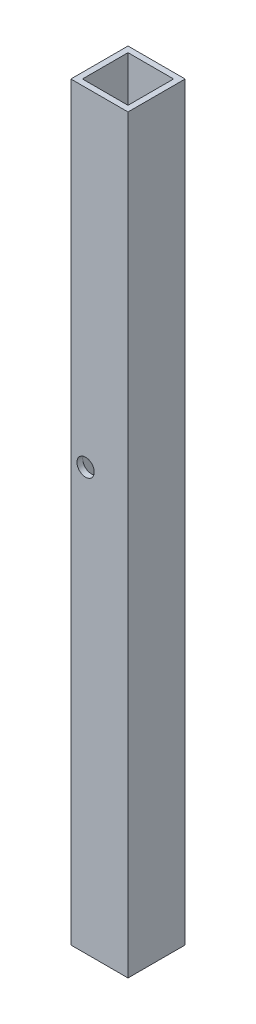
ISO-10303-21;
HEADER;
FILE_DESCRIPTION(('STEP AP214'),'2;1');
FILE_NAME('part.step','',(''),(''),'','','');
FILE_SCHEMA(('AUTOMOTIVE_DESIGN { 1 0 10303 214 1 1 1 1 }'));
ENDSEC;
DATA;
#1=APPLICATION_CONTEXT('core data for automotive mechanical design processes');
#2=APPLICATION_PROTOCOL_DEFINITION('international standard','automotive_design',2000,#1);
#3=PRODUCT_CONTEXT('',#1,'mechanical');
#4=PRODUCT('Part','Part','',(#3));
#5=PRODUCT_RELATED_PRODUCT_CATEGORY('part','',(#4));
#6=PRODUCT_DEFINITION_FORMATION('','',#4);
#7=PRODUCT_DEFINITION_CONTEXT('part definition',#1,'design');
#8=PRODUCT_DEFINITION('design','',#6,#7);
#9=PRODUCT_DEFINITION_SHAPE('','',#8);
#10=(LENGTH_UNIT() NAMED_UNIT(*) SI_UNIT(.MILLI.,.METRE.));
#11=(NAMED_UNIT(*) PLANE_ANGLE_UNIT() SI_UNIT($,.RADIAN.));
#12=(NAMED_UNIT(*) SI_UNIT($,.STERADIAN.) SOLID_ANGLE_UNIT());
#13=UNCERTAINTY_MEASURE_WITH_UNIT(LENGTH_MEASURE(1.E-05),#10,'distance_accuracy_value','');
#14=(GEOMETRIC_REPRESENTATION_CONTEXT(3) GLOBAL_UNCERTAINTY_ASSIGNED_CONTEXT((#13)) GLOBAL_UNIT_ASSIGNED_CONTEXT((#10,
#11,#12)) REPRESENTATION_CONTEXT('',''));
#15=CARTESIAN_POINT('',(0.,0.,0.));
#16=DIRECTION('',(0.,0.,1.));
#17=DIRECTION('',(1.,0.,0.));
#18=AXIS2_PLACEMENT_3D('',#15,#16,#17);
#19=CARTESIAN_POINT('',(0.,130.,0.));
#20=DIRECTION('',(0.,1.,0.));
#21=DIRECTION('',(0.,0.,1.));
#22=AXIS2_PLACEMENT_3D('',#19,#20,#21);
#23=PLANE('',#22);
#24=DIRECTION('',(0.,0.,1.));
#25=VECTOR('',#24,1.);
#26=CARTESIAN_POINT('',(-4.95,130.,4.95));
#27=LINE('',#26,#25);
#28=CARTESIAN_POINT('',(-4.95,130.,-4.95));
#29=VERTEX_POINT('',#28);
#30=CARTESIAN_POINT('',(-4.95,130.,4.95));
#31=VERTEX_POINT('',#30);
#32=EDGE_CURVE('E139',#29,#31,#27,.T.);
#33=ORIENTED_EDGE('',*,*,#32,.T.);
#34=DIRECTION('',(1.,0.,0.));
#35=VECTOR('',#34,1.);
#36=CARTESIAN_POINT('',(4.95,130.,4.95));
#37=LINE('',#36,#35);
#38=CARTESIAN_POINT('',(4.95,130.,4.95));
#39=VERTEX_POINT('',#38);
#40=EDGE_CURVE('E142',#31,#39,#37,.T.);
#41=ORIENTED_EDGE('',*,*,#40,.T.);
#42=DIRECTION('',(0.,0.,-1.));
#43=VECTOR('',#42,1.);
#44=CARTESIAN_POINT('',(4.95,130.,4.95));
#45=LINE('',#44,#43);
#46=CARTESIAN_POINT('',(4.95,130.,-4.95));
#47=VERTEX_POINT('',#46);
#48=EDGE_CURVE('E145',#39,#47,#45,.T.);
#49=ORIENTED_EDGE('',*,*,#48,.T.);
#50=DIRECTION('',(-1.,0.,0.));
#51=VECTOR('',#50,1.);
#52=CARTESIAN_POINT('',(4.95,130.,-4.95));
#53=LINE('',#52,#51);
#54=EDGE_CURVE('E147',#47,#29,#53,.T.);
#55=ORIENTED_EDGE('',*,*,#54,.T.);
#56=EDGE_LOOP('',(#33,#41,#49,#55));
#57=FACE_BOUND('',#56,.T.);
#58=DIRECTION('',(-1.,0.,0.));
#59=VECTOR('',#58,1.);
#60=CARTESIAN_POINT('',(-3.95,130.,-3.95));
#61=LINE('',#60,#59);
#62=CARTESIAN_POINT('',(3.95,130.,-3.95));
#63=VERTEX_POINT('',#62);
#64=CARTESIAN_POINT('',(-3.95,130.,-3.95));
#65=VERTEX_POINT('',#64);
#66=EDGE_CURVE('E109',#63,#65,#61,.T.);
#67=ORIENTED_EDGE('',*,*,#66,.F.);
#68=DIRECTION('',(0.,0.,-1.));
#69=VECTOR('',#68,1.);
#70=CARTESIAN_POINT('',(3.95,130.,3.95));
#71=LINE('',#70,#69);
#72=CARTESIAN_POINT('',(3.95,130.,3.95));
#73=VERTEX_POINT('',#72);
#74=EDGE_CURVE('E101',#73,#63,#71,.T.);
#75=ORIENTED_EDGE('',*,*,#74,.F.);
#76=DIRECTION('',(1.,0.,0.));
#77=VECTOR('',#76,1.);
#78=CARTESIAN_POINT('',(-3.95,130.,3.95));
#79=LINE('',#78,#77);
#80=CARTESIAN_POINT('',(-3.95,130.,3.95));
#81=VERTEX_POINT('',#80);
#82=EDGE_CURVE('E123',#81,#73,#79,.T.);
#83=ORIENTED_EDGE('',*,*,#82,.F.);
#84=DIRECTION('',(0.,0.,1.));
#85=VECTOR('',#84,1.);
#86=CARTESIAN_POINT('',(-3.95,130.,3.95));
#87=LINE('',#86,#85);
#88=EDGE_CURVE('E121',#65,#81,#87,.T.);
#89=ORIENTED_EDGE('',*,*,#88,.F.);
#90=EDGE_LOOP('',(#67,#75,#83,#89));
#91=FACE_BOUND('',#90,.T.);
#92=ADVANCED_FACE('F35',(#57,#91),#23,.T.);
#93=CARTESIAN_POINT('',(0.,0.,0.));
#94=DIRECTION('',(0.,1.,0.));
#95=DIRECTION('',(0.,0.,1.));
#96=AXIS2_PLACEMENT_3D('',#93,#94,#95);
#97=PLANE('',#96);
#98=DIRECTION('',(0.,0.,1.));
#99=VECTOR('',#98,1.);
#100=CARTESIAN_POINT('',(-4.95,0.,4.95));
#101=LINE('',#100,#99);
#102=CARTESIAN_POINT('',(-4.95,0.,-4.95));
#103=VERTEX_POINT('',#102);
#104=CARTESIAN_POINT('',(-4.95,0.,4.95));
#105=VERTEX_POINT('',#104);
#106=EDGE_CURVE('E117',#103,#105,#101,.T.);
#107=ORIENTED_EDGE('',*,*,#106,.F.);
#108=DIRECTION('',(-1.,0.,0.));
#109=VECTOR('',#108,1.);
#110=CARTESIAN_POINT('',(4.95,0.,-4.95));
#111=LINE('',#110,#109);
#112=CARTESIAN_POINT('',(4.95,0.,-4.95));
#113=VERTEX_POINT('',#112);
#114=EDGE_CURVE('E143',#113,#103,#111,.T.);
#115=ORIENTED_EDGE('',*,*,#114,.F.);
#116=DIRECTION('',(0.,0.,-1.));
#117=VECTOR('',#116,1.);
#118=CARTESIAN_POINT('',(4.95,0.,4.95));
#119=LINE('',#118,#117);
#120=CARTESIAN_POINT('',(4.95,0.,4.95));
#121=VERTEX_POINT('',#120);
#122=EDGE_CURVE('E154',#121,#113,#119,.T.);
#123=ORIENTED_EDGE('',*,*,#122,.F.);
#124=DIRECTION('',(1.,0.,0.));
#125=VECTOR('',#124,1.);
#126=CARTESIAN_POINT('',(4.95,0.,4.95));
#127=LINE('',#126,#125);
#128=EDGE_CURVE('E152',#105,#121,#127,.T.);
#129=ORIENTED_EDGE('',*,*,#128,.F.);
#130=EDGE_LOOP('',(#107,#115,#123,#129));
#131=FACE_BOUND('',#130,.T.);
#132=DIRECTION('',(0.,0.,-1.));
#133=VECTOR('',#132,1.);
#134=CARTESIAN_POINT('',(3.95,0.,3.95));
#135=LINE('',#134,#133);
#136=CARTESIAN_POINT('',(3.95,0.,3.95));
#137=VERTEX_POINT('',#136);
#138=CARTESIAN_POINT('',(3.95,0.,-3.95));
#139=VERTEX_POINT('',#138);
#140=EDGE_CURVE('E59',#137,#139,#135,.T.);
#141=ORIENTED_EDGE('',*,*,#140,.T.);
#142=DIRECTION('',(-1.,0.,0.));
#143=VECTOR('',#142,1.);
#144=CARTESIAN_POINT('',(-3.95,0.,-3.95));
#145=LINE('',#144,#143);
#146=CARTESIAN_POINT('',(-3.95,0.,-3.95));
#147=VERTEX_POINT('',#146);
#148=EDGE_CURVE('E116',#139,#147,#145,.T.);
#149=ORIENTED_EDGE('',*,*,#148,.T.);
#150=DIRECTION('',(0.,0.,1.));
#151=VECTOR('',#150,1.);
#152=CARTESIAN_POINT('',(-3.95,0.,3.95));
#153=LINE('',#152,#151);
#154=CARTESIAN_POINT('',(-3.95,0.,3.95));
#155=VERTEX_POINT('',#154);
#156=EDGE_CURVE('E131',#147,#155,#153,.T.);
#157=ORIENTED_EDGE('',*,*,#156,.T.);
#158=DIRECTION('',(1.,0.,0.));
#159=VECTOR('',#158,1.);
#160=CARTESIAN_POINT('',(-3.95,0.,3.95));
#161=LINE('',#160,#159);
#162=EDGE_CURVE('E110',#155,#137,#161,.T.);
#163=ORIENTED_EDGE('',*,*,#162,.T.);
#164=EDGE_LOOP('',(#141,#149,#157,#163));
#165=FACE_BOUND('',#164,.T.);
#166=ADVANCED_FACE('F173',(#131,#165),#97,.F.);
#167=CARTESIAN_POINT('',(-4.95,130.,4.95));
#168=DIRECTION('',(1.,0.,0.));
#169=DIRECTION('',(0.,0.,-1.));
#170=AXIS2_PLACEMENT_3D('',#167,#168,#169);
#171=PLANE('',#170);
#172=ORIENTED_EDGE('',*,*,#106,.T.);
#173=DIRECTION('',(0.,-1.,0.));
#174=VECTOR('',#173,1.);
#175=CARTESIAN_POINT('',(-4.95,130.,4.95));
#176=LINE('',#175,#174);
#177=EDGE_CURVE('E11',#31,#105,#176,.T.);
#178=ORIENTED_EDGE('',*,*,#177,.F.);
#179=ORIENTED_EDGE('',*,*,#32,.F.);
#180=DIRECTION('',(0.,-1.,0.));
#181=VECTOR('',#180,1.);
#182=CARTESIAN_POINT('',(-4.95,130.,-4.95));
#183=LINE('',#182,#181);
#184=EDGE_CURVE('E149',#29,#103,#183,.T.);
#185=ORIENTED_EDGE('',*,*,#184,.T.);
#186=EDGE_LOOP('',(#172,#178,#179,#185));
#187=FACE_BOUND('',#186,.T.);
#188=ADVANCED_FACE('F37',(#187),#171,.F.);
#189=CARTESIAN_POINT('',(4.95,130.,4.95));
#190=DIRECTION('',(0.,0.,-1.));
#191=DIRECTION('',(-1.,0.,0.));
#192=AXIS2_PLACEMENT_3D('',#189,#190,#191);
#193=PLANE('',#192);
#194=CARTESIAN_POINT('',(-2.40000000000001,73.,4.95));
#195=DIRECTION('',(0.,0.,-1.));
#196=DIRECTION('',(-1.,0.,0.));
#197=AXIS2_PLACEMENT_3D('',#194,#195,#196);
#198=CIRCLE('',#197,1.5);
#199=CARTESIAN_POINT('',(-3.90000000000002,73.,4.95));
#200=VERTEX_POINT('',#199);
#201=EDGE_CURVE('E210',#200,#200,#198,.T.);
#202=ORIENTED_EDGE('',*,*,#201,.T.);
#203=EDGE_LOOP('',(#202));
#204=FACE_BOUND('',#203,.T.);
#205=ORIENTED_EDGE('',*,*,#128,.T.);
#206=DIRECTION('',(0.,-1.,0.));
#207=VECTOR('',#206,1.);
#208=CARTESIAN_POINT('',(4.95,130.,4.95));
#209=LINE('',#208,#207);
#210=EDGE_CURVE('E44',#39,#121,#209,.T.);
#211=ORIENTED_EDGE('',*,*,#210,.F.);
#212=ORIENTED_EDGE('',*,*,#40,.F.);
#213=ORIENTED_EDGE('',*,*,#177,.T.);
#214=EDGE_LOOP('',(#205,#211,#212,#213));
#215=FACE_BOUND('',#214,.T.);
#216=ADVANCED_FACE('F183',(#204,#215),#193,.F.);
#217=CARTESIAN_POINT('',(4.95,130.,4.95));
#218=DIRECTION('',(-1.,0.,0.));
#219=DIRECTION('',(0.,0.,1.));
#220=AXIS2_PLACEMENT_3D('',#217,#218,#219);
#221=PLANE('',#220);
#222=ORIENTED_EDGE('',*,*,#122,.T.);
#223=DIRECTION('',(0.,-1.,0.));
#224=VECTOR('',#223,1.);
#225=CARTESIAN_POINT('',(4.95,130.,-4.95));
#226=LINE('',#225,#224);
#227=EDGE_CURVE('E159',#47,#113,#226,.T.);
#228=ORIENTED_EDGE('',*,*,#227,.F.);
#229=ORIENTED_EDGE('',*,*,#48,.F.);
#230=ORIENTED_EDGE('',*,*,#210,.T.);
#231=EDGE_LOOP('',(#222,#228,#229,#230));
#232=FACE_BOUND('',#231,.T.);
#233=ADVANCED_FACE('F167',(#232),#221,.F.);
#234=CARTESIAN_POINT('',(4.95,130.,-4.95));
#235=DIRECTION('',(0.,0.,1.));
#236=DIRECTION('',(1.,0.,0.));
#237=AXIS2_PLACEMENT_3D('',#234,#235,#236);
#238=PLANE('',#237);
#239=CARTESIAN_POINT('',(-2.40000000000002,73.,-4.95));
#240=DIRECTION('',(0.,0.,-1.));
#241=DIRECTION('',(-1.,0.,0.));
#242=AXIS2_PLACEMENT_3D('',#239,#240,#241);
#243=CIRCLE('',#242,1.5);
#244=CARTESIAN_POINT('',(-3.90000000000002,73.,-4.95));
#245=VERTEX_POINT('',#244);
#246=EDGE_CURVE('E208',#245,#245,#243,.T.);
#247=ORIENTED_EDGE('',*,*,#246,.F.);
#248=EDGE_LOOP('',(#247));
#249=FACE_BOUND('',#248,.T.);
#250=ORIENTED_EDGE('',*,*,#114,.T.);
#251=ORIENTED_EDGE('',*,*,#184,.F.);
#252=ORIENTED_EDGE('',*,*,#54,.F.);
#253=ORIENTED_EDGE('',*,*,#227,.T.);
#254=EDGE_LOOP('',(#250,#251,#252,#253));
#255=FACE_BOUND('',#254,.T.);
#256=ADVANCED_FACE('F177',(#249,#255),#238,.F.);
#257=CARTESIAN_POINT('',(3.95,130.,3.95));
#258=DIRECTION('',(-1.,0.,0.));
#259=DIRECTION('',(0.,0.,1.));
#260=AXIS2_PLACEMENT_3D('',#257,#258,#259);
#261=PLANE('',#260);
#262=ORIENTED_EDGE('',*,*,#140,.F.);
#263=DIRECTION('',(0.,-1.,0.));
#264=VECTOR('',#263,1.);
#265=CARTESIAN_POINT('',(3.95,130.,3.95));
#266=LINE('',#265,#264);
#267=EDGE_CURVE('E105',#73,#137,#266,.T.);
#268=ORIENTED_EDGE('',*,*,#267,.F.);
#269=ORIENTED_EDGE('',*,*,#74,.T.);
#270=DIRECTION('',(0.,-1.,0.));
#271=VECTOR('',#270,1.);
#272=CARTESIAN_POINT('',(3.95,130.,-3.95));
#273=LINE('',#272,#271);
#274=EDGE_CURVE('E104',#63,#139,#273,.T.);
#275=ORIENTED_EDGE('',*,*,#274,.T.);
#276=EDGE_LOOP('',(#262,#268,#269,#275));
#277=FACE_BOUND('',#276,.T.);
#278=ADVANCED_FACE('F103',(#277),#261,.T.);
#279=CARTESIAN_POINT('',(-3.95,130.,-3.95));
#280=DIRECTION('',(0.,0.,1.));
#281=DIRECTION('',(1.,0.,0.));
#282=AXIS2_PLACEMENT_3D('',#279,#280,#281);
#283=PLANE('',#282);
#284=CARTESIAN_POINT('',(-2.40000000000002,73.,-3.95));
#285=DIRECTION('',(0.,0.,1.));
#286=DIRECTION('',(1.,0.,0.));
#287=AXIS2_PLACEMENT_3D('',#284,#285,#286);
#288=CIRCLE('',#287,1.5);
#289=CARTESIAN_POINT('',(-0.900000000000013,73.,-3.95));
#290=VERTEX_POINT('',#289);
#291=EDGE_CURVE('E129',#290,#290,#288,.T.);
#292=ORIENTED_EDGE('',*,*,#291,.F.);
#293=EDGE_LOOP('',(#292));
#294=FACE_BOUND('',#293,.T.);
#295=ORIENTED_EDGE('',*,*,#148,.F.);
#296=ORIENTED_EDGE('',*,*,#274,.F.);
#297=ORIENTED_EDGE('',*,*,#66,.T.);
#298=DIRECTION('',(0.,-1.,0.));
#299=VECTOR('',#298,1.);
#300=CARTESIAN_POINT('',(-3.95,130.,-3.95));
#301=LINE('',#300,#299);
#302=EDGE_CURVE('E118',#65,#147,#301,.T.);
#303=ORIENTED_EDGE('',*,*,#302,.T.);
#304=EDGE_LOOP('',(#295,#296,#297,#303));
#305=FACE_BOUND('',#304,.T.);
#306=ADVANCED_FACE('F113',(#294,#305),#283,.T.);
#307=CARTESIAN_POINT('',(-3.95,130.,3.95));
#308=DIRECTION('',(1.,0.,0.));
#309=DIRECTION('',(0.,0.,-1.));
#310=AXIS2_PLACEMENT_3D('',#307,#308,#309);
#311=PLANE('',#310);
#312=ORIENTED_EDGE('',*,*,#156,.F.);
#313=ORIENTED_EDGE('',*,*,#302,.F.);
#314=ORIENTED_EDGE('',*,*,#88,.T.);
#315=DIRECTION('',(0.,-1.,0.));
#316=VECTOR('',#315,1.);
#317=CARTESIAN_POINT('',(-3.95,130.,3.95));
#318=LINE('',#317,#316);
#319=EDGE_CURVE('E51',#81,#155,#318,.T.);
#320=ORIENTED_EDGE('',*,*,#319,.T.);
#321=EDGE_LOOP('',(#312,#313,#314,#320));
#322=FACE_BOUND('',#321,.T.);
#323=ADVANCED_FACE('F224',(#322),#311,.T.);
#324=CARTESIAN_POINT('',(-3.95,130.,3.95));
#325=DIRECTION('',(0.,0.,-1.));
#326=DIRECTION('',(-1.,0.,0.));
#327=AXIS2_PLACEMENT_3D('',#324,#325,#326);
#328=PLANE('',#327);
#329=CARTESIAN_POINT('',(-2.40000000000001,73.,3.95));
#330=DIRECTION('',(0.,0.,-1.));
#331=DIRECTION('',(-1.,0.,0.));
#332=AXIS2_PLACEMENT_3D('',#329,#330,#331);
#333=CIRCLE('',#332,1.5);
#334=CARTESIAN_POINT('',(-3.90000000000002,73.,3.95));
#335=VERTEX_POINT('',#334);
#336=EDGE_CURVE('E39',#335,#335,#333,.T.);
#337=ORIENTED_EDGE('',*,*,#336,.F.);
#338=EDGE_LOOP('',(#337));
#339=FACE_BOUND('',#338,.T.);
#340=ORIENTED_EDGE('',*,*,#162,.F.);
#341=ORIENTED_EDGE('',*,*,#319,.F.);
#342=ORIENTED_EDGE('',*,*,#82,.T.);
#343=ORIENTED_EDGE('',*,*,#267,.T.);
#344=EDGE_LOOP('',(#340,#341,#342,#343));
#345=FACE_BOUND('',#344,.T.);
#346=ADVANCED_FACE('F222',(#339,#345),#328,.T.);
#347=CARTESIAN_POINT('',(-2.40000000000001,73.,4.95));
#348=DIRECTION('',(0.,0.,-1.));
#349=DIRECTION('',(-1.,0.,0.));
#350=AXIS2_PLACEMENT_3D('',#347,#348,#349);
#351=CYLINDRICAL_SURFACE('',#350,1.5);
#352=ORIENTED_EDGE('',*,*,#336,.T.);
#353=EDGE_LOOP('',(#352));
#354=FACE_BOUND('',#353,.T.);
#355=ORIENTED_EDGE('',*,*,#201,.F.);
#356=EDGE_LOOP('',(#355));
#357=FACE_BOUND('',#356,.T.);
#358=ADVANCED_FACE('F219',(#354,#357),#351,.F.);
#359=ORIENTED_EDGE('',*,*,#291,.T.);
#360=EDGE_LOOP('',(#359));
#361=FACE_BOUND('',#360,.T.);
#362=ORIENTED_EDGE('',*,*,#246,.T.);
#363=EDGE_LOOP('',(#362));
#364=FACE_BOUND('',#363,.T.);
#365=ADVANCED_FACE('F236',(#361,#364),#351,.F.);
#366=CLOSED_SHELL('',(#92,#166,#188,#216,#233,#256,#278,#306,#323,#346,#358,#365));
#367=MANIFOLD_SOLID_BREP('B2',#366);
#368=ADVANCED_BREP_SHAPE_REPRESENTATION('',(#18,#367),#14);
#369=SHAPE_DEFINITION_REPRESENTATION(#9,#368);
ENDSEC;
END-ISO-10303-21;
